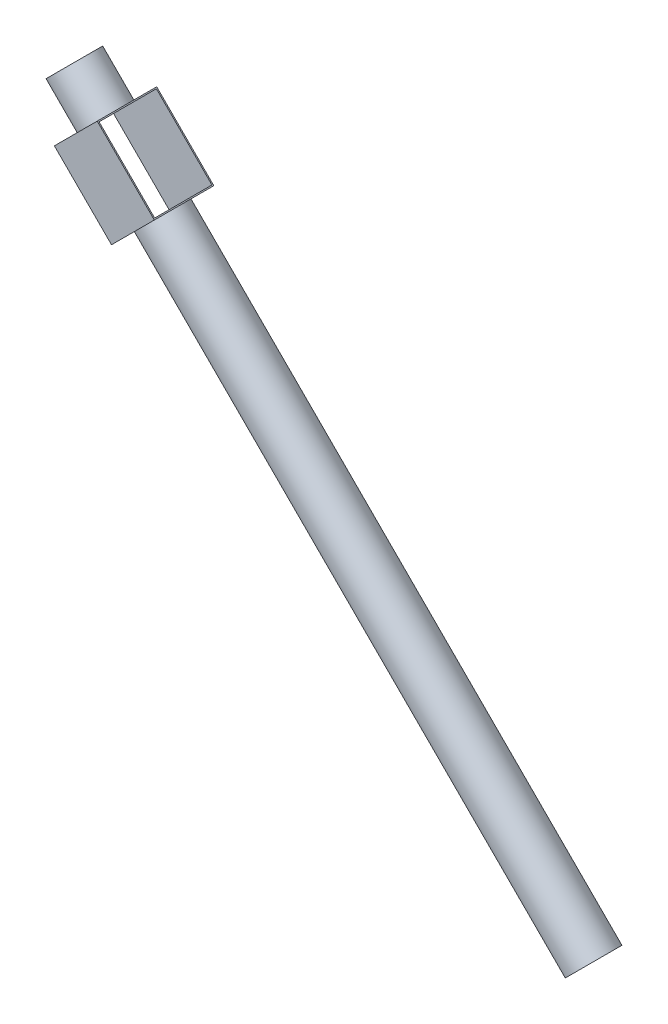
ISO-10303-21;
HEADER;
FILE_DESCRIPTION(('STEP AP214'),'2;1');
FILE_NAME('part.step','',(''),(''),'','','');
FILE_SCHEMA(('AUTOMOTIVE_DESIGN { 1 0 10303 214 1 1 1 1 }'));
ENDSEC;
DATA;
#1=APPLICATION_CONTEXT('core data for automotive mechanical design processes');
#2=APPLICATION_PROTOCOL_DEFINITION('international standard','automotive_design',2000,#1);
#3=PRODUCT_CONTEXT('',#1,'mechanical');
#4=PRODUCT('Part','Part','',(#3));
#5=PRODUCT_RELATED_PRODUCT_CATEGORY('part','',(#4));
#6=PRODUCT_DEFINITION_FORMATION('','',#4);
#7=PRODUCT_DEFINITION_CONTEXT('part definition',#1,'design');
#8=PRODUCT_DEFINITION('design','',#6,#7);
#9=PRODUCT_DEFINITION_SHAPE('','',#8);
#10=(LENGTH_UNIT() NAMED_UNIT(*) SI_UNIT(.MILLI.,.METRE.));
#11=(NAMED_UNIT(*) PLANE_ANGLE_UNIT() SI_UNIT($,.RADIAN.));
#12=(NAMED_UNIT(*) SI_UNIT($,.STERADIAN.) SOLID_ANGLE_UNIT());
#13=UNCERTAINTY_MEASURE_WITH_UNIT(LENGTH_MEASURE(1.E-05),#10,'distance_accuracy_value','');
#14=(GEOMETRIC_REPRESENTATION_CONTEXT(3) GLOBAL_UNCERTAINTY_ASSIGNED_CONTEXT((#13)) GLOBAL_UNIT_ASSIGNED_CONTEXT((#10,
#11,#12)) REPRESENTATION_CONTEXT('',''));
#15=CARTESIAN_POINT('',(0.,0.,0.));
#16=DIRECTION('',(0.,0.,1.));
#17=DIRECTION('',(1.,0.,0.));
#18=AXIS2_PLACEMENT_3D('',#15,#16,#17);
#19=CARTESIAN_POINT('',(-1325.54665954363,1414.2135623731,-27.5663130260426));
#20=DIRECTION('',(0.707106781186544,-0.707106781186551,0.));
#21=DIRECTION('',(0.707106781186551,0.707106781186544,0.));
#22=AXIS2_PLACEMENT_3D('',#19,#20,#21);
#23=CYLINDRICAL_SURFACE('',#22,63.);
#24=CARTESIAN_POINT('',(88.6669028294591,0.,-27.5663130260426));
#25=DIRECTION('',(0.707106781186544,-0.707106781186551,0.));
#26=DIRECTION('',(0.707106781186551,0.707106781186544,0.));
#27=AXIS2_PLACEMENT_3D('',#24,#25,#26);
#28=CIRCLE('',#27,63.);
#29=CARTESIAN_POINT('',(133.214630044212,44.5477272147522,-27.5663130260426));
#30=VERTEX_POINT('',#29);
#31=EDGE_CURVE('E216',#30,#30,#28,.T.);
#32=ORIENTED_EDGE('',*,*,#31,.F.);
#33=EDGE_LOOP('',(#32));
#34=FACE_BOUND('',#33,.T.);
#35=CARTESIAN_POINT('',(-1085.1303539402,1173.79725676967,-27.5663130260426));
#36=DIRECTION('',(-0.707106781186546,0.707106781186549,0.));
#37=DIRECTION('',(-0.707106781186549,-0.707106781186546,0.));
#38=AXIS2_PLACEMENT_3D('',#35,#36,#37);
#39=CIRCLE('',#38,63.);
#40=CARTESIAN_POINT('',(-1129.67808115496,1129.24952955492,-27.5663130260426));
#41=VERTEX_POINT('',#40);
#42=EDGE_CURVE('E207',#41,#41,#39,.F.);
#43=ORIENTED_EDGE('',*,*,#42,.T.);
#44=EDGE_LOOP('',(#43));
#45=FACE_BOUND('',#44,.T.);
#46=ADVANCED_FACE('F49',(#34,#45),#23,.T.);
#47=CARTESIAN_POINT('',(-1325.54665954363,1414.2135623731,-27.5663130260426));
#48=DIRECTION('',(0.707106781186544,-0.707106781186551,0.));
#49=DIRECTION('',(0.707106781186551,0.707106781186544,0.));
#50=AXIS2_PLACEMENT_3D('',#47,#48,#49);
#51=CYLINDRICAL_SURFACE('',#50,60.);
#52=CARTESIAN_POINT('',(88.6669028294591,0.,-27.5663130260426));
#53=DIRECTION('',(0.707106781186544,-0.707106781186551,0.));
#54=DIRECTION('',(0.707106781186551,0.707106781186544,0.));
#55=AXIS2_PLACEMENT_3D('',#52,#53,#54);
#56=CIRCLE('',#55,60.);
#57=CARTESIAN_POINT('',(131.093309700652,42.4264068711926,-27.5663130260426));
#58=VERTEX_POINT('',#57);
#59=EDGE_CURVE('E211',#58,#58,#56,.T.);
#60=ORIENTED_EDGE('',*,*,#59,.T.);
#61=EDGE_LOOP('',(#60));
#62=FACE_BOUND('',#61,.T.);
#63=CARTESIAN_POINT('',(-1085.1303539402,1173.79725676967,-27.5663130260426));
#64=DIRECTION('',(-0.707106781186546,0.707106781186549,0.));
#65=DIRECTION('',(-0.707106781186549,-0.707106781186546,0.));
#66=AXIS2_PLACEMENT_3D('',#63,#64,#65);
#67=CIRCLE('',#66,60.);
#68=CARTESIAN_POINT('',(-1127.5567608114,1131.37084989848,-27.5663130260426));
#69=VERTEX_POINT('',#68);
#70=EDGE_CURVE('E53',#69,#69,#67,.F.);
#71=ORIENTED_EDGE('',*,*,#70,.F.);
#72=EDGE_LOOP('',(#71));
#73=FACE_BOUND('',#72,.T.);
#74=ADVANCED_FACE('F245',(#62,#73),#51,.F.);
#75=CARTESIAN_POINT('',(88.6669028294591,0.,-27.5663130260426));
#76=DIRECTION('',(0.707106781186544,-0.707106781186551,0.));
#77=DIRECTION('',(0.707106781186551,0.707106781186544,0.));
#78=AXIS2_PLACEMENT_3D('',#75,#76,#77);
#79=PLANE('',#78);
#80=ORIENTED_EDGE('',*,*,#59,.F.);
#81=EDGE_LOOP('',(#80));
#82=FACE_BOUND('',#81,.T.);
#83=ORIENTED_EDGE('',*,*,#31,.T.);
#84=EDGE_LOOP('',(#83));
#85=FACE_BOUND('',#84,.T.);
#86=ADVANCED_FACE('F257',(#82,#85),#79,.T.);
#87=CARTESIAN_POINT('',(-1026.79404449232,1232.13356621756,53.4336869739574));
#88=DIRECTION('',(-0.707106781186546,0.707106781186549,0.));
#89=DIRECTION('',(-0.707106781186549,-0.707106781186546,0.));
#90=AXIS2_PLACEMENT_3D('',#87,#88,#89);
#91=PLANE('',#90);
#92=ORIENTED_EDGE('',*,*,#70,.T.);
#93=EDGE_LOOP('',(#92));
#94=FACE_BOUND('',#93,.T.);
#95=ADVANCED_FACE('F295',(#94),#91,.F.);
#96=ORIENTED_EDGE('',*,*,#42,.F.);
#97=EDGE_LOOP('',(#96));
#98=FACE_BOUND('',#97,.T.);
#99=DIRECTION('',(0.,0.,-1.));
#100=VECTOR('',#99,1.);
#101=CARTESIAN_POINT('',(-1143.4666633881,1115.46094732178,53.4336869739574));
#102=LINE('',#101,#100);
#103=CARTESIAN_POINT('',(-1143.4666633881,1115.46094732178,53.4336869739574));
#104=VERTEX_POINT('',#103);
#105=CARTESIAN_POINT('',(-1143.4666633881,1115.46094732178,-108.566313026043));
#106=VERTEX_POINT('',#105);
#107=EDGE_CURVE('E159',#104,#106,#102,.T.);
#108=ORIENTED_EDGE('',*,*,#107,.T.);
#109=DIRECTION('',(-0.707106781186549,-0.707106781186546,0.));
#110=VECTOR('',#109,1.);
#111=CARTESIAN_POINT('',(-1026.79404449232,1232.13356621756,-108.566313026043));
#112=LINE('',#111,#110);
#113=CARTESIAN_POINT('',(-1026.79404449232,1232.13356621756,-108.566313026043));
#114=VERTEX_POINT('',#113);
#115=EDGE_CURVE('E203',#114,#106,#112,.T.);
#116=ORIENTED_EDGE('',*,*,#115,.F.);
#117=DIRECTION('',(0.,0.,-1.));
#118=VECTOR('',#117,1.);
#119=CARTESIAN_POINT('',(-1026.79404449232,1232.13356621756,53.4336869739574));
#120=LINE('',#119,#118);
#121=CARTESIAN_POINT('',(-1026.79404449232,1232.13356621756,53.4336869739574));
#122=VERTEX_POINT('',#121);
#123=EDGE_CURVE('E165',#122,#114,#120,.T.);
#124=ORIENTED_EDGE('',*,*,#123,.F.);
#125=DIRECTION('',(-0.707106781186549,-0.707106781186546,0.));
#126=VECTOR('',#125,1.);
#127=CARTESIAN_POINT('',(-1026.79404449232,1232.13356621756,53.4336869739574));
#128=LINE('',#127,#126);
#129=EDGE_CURVE('E180',#122,#104,#128,.T.);
#130=ORIENTED_EDGE('',*,*,#129,.T.);
#131=EDGE_LOOP('',(#108,#116,#124,#130));
#132=FACE_BOUND('',#131,.T.);
#133=ADVANCED_FACE('F285',(#98,#132),#91,.F.);
#134=CARTESIAN_POINT('',(-1182.35753635336,1387.6970580786,-108.566313026043));
#135=DIRECTION('',(0.,0.,-1.));
#136=DIRECTION('',(0.,1.,0.));
#137=AXIS2_PLACEMENT_3D('',#134,#135,#136);
#138=PLANE('',#137);
#139=DIRECTION('',(0.707106781186547,-0.707106781186549,0.));
#140=VECTOR('',#139,1.);
#141=CARTESIAN_POINT('',(-1299.03015524914,1271.02443918282,-108.566313026043));
#142=LINE('',#141,#140);
#143=CARTESIAN_POINT('',(-1299.03015524914,1271.02443918282,-108.566313026043));
#144=VERTEX_POINT('',#143);
#145=EDGE_CURVE('E184',#144,#106,#142,.T.);
#146=ORIENTED_EDGE('',*,*,#145,.F.);
#147=DIRECTION('',(-0.707106781186549,-0.707106781186546,0.));
#148=VECTOR('',#147,1.);
#149=CARTESIAN_POINT('',(-1182.35753635336,1387.6970580786,-108.566313026043));
#150=LINE('',#149,#148);
#151=CARTESIAN_POINT('',(-1182.35753635336,1387.6970580786,-108.566313026043));
#152=VERTEX_POINT('',#151);
#153=EDGE_CURVE('E200',#152,#144,#150,.T.);
#154=ORIENTED_EDGE('',*,*,#153,.F.);
#155=DIRECTION('',(0.707106781186547,-0.707106781186549,0.));
#156=VECTOR('',#155,1.);
#157=CARTESIAN_POINT('',(-1182.35753635336,1387.6970580786,-108.566313026043));
#158=LINE('',#157,#156);
#159=EDGE_CURVE('E168',#152,#114,#158,.T.);
#160=ORIENTED_EDGE('',*,*,#159,.T.);
#161=ORIENTED_EDGE('',*,*,#115,.T.);
#162=EDGE_LOOP('',(#146,#154,#160,#161));
#163=FACE_BOUND('',#162,.T.);
#164=ADVANCED_FACE('F250',(#163),#138,.T.);
#165=CARTESIAN_POINT('',(-1182.35753635336,1387.6970580786,53.4336869739574));
#166=DIRECTION('',(-0.707106781186546,0.707106781186549,0.));
#167=DIRECTION('',(-0.707106781186549,-0.707106781186546,0.));
#168=AXIS2_PLACEMENT_3D('',#165,#166,#167);
#169=PLANE('',#168);
#170=CARTESIAN_POINT('',(-1240.69384580124,1329.36074863072,-27.5663130260426));
#171=DIRECTION('',(-0.707106781186546,0.707106781186549,0.));
#172=DIRECTION('',(-0.707106781186549,-0.707106781186546,0.));
#173=AXIS2_PLACEMENT_3D('',#170,#171,#172);
#174=CIRCLE('',#173,63.);
#175=CARTESIAN_POINT('',(-1285.241573016,1284.81302141596,-27.5663130260426));
#176=VERTEX_POINT('',#175);
#177=EDGE_CURVE('E11',#176,#176,#174,.F.);
#178=ORIENTED_EDGE('',*,*,#177,.T.);
#179=EDGE_LOOP('',(#178));
#180=FACE_BOUND('',#179,.T.);
#181=DIRECTION('',(0.,0.,-1.));
#182=VECTOR('',#181,1.);
#183=CARTESIAN_POINT('',(-1299.03015524914,1271.02443918282,53.4336869739574));
#184=LINE('',#183,#182);
#185=CARTESIAN_POINT('',(-1299.03015524914,1271.02443918282,53.4336869739574));
#186=VERTEX_POINT('',#185);
#187=EDGE_CURVE('E188',#186,#144,#184,.T.);
#188=ORIENTED_EDGE('',*,*,#187,.F.);
#189=DIRECTION('',(-0.707106781186549,-0.707106781186546,0.));
#190=VECTOR('',#189,1.);
#191=CARTESIAN_POINT('',(-1182.35753635336,1387.6970580786,53.4336869739574));
#192=LINE('',#191,#190);
#193=CARTESIAN_POINT('',(-1182.35753635336,1387.6970580786,53.4336869739574));
#194=VERTEX_POINT('',#193);
#195=EDGE_CURVE('E197',#194,#186,#192,.T.);
#196=ORIENTED_EDGE('',*,*,#195,.F.);
#197=DIRECTION('',(0.,0.,-1.));
#198=VECTOR('',#197,1.);
#199=CARTESIAN_POINT('',(-1182.35753635336,1387.6970580786,53.4336869739574));
#200=LINE('',#199,#198);
#201=EDGE_CURVE('E173',#194,#152,#200,.T.);
#202=ORIENTED_EDGE('',*,*,#201,.T.);
#203=ORIENTED_EDGE('',*,*,#153,.T.);
#204=EDGE_LOOP('',(#188,#196,#202,#203));
#205=FACE_BOUND('',#204,.T.);
#206=ADVANCED_FACE('F236',(#180,#205),#169,.T.);
#207=CARTESIAN_POINT('',(-1182.35753635336,1387.6970580786,53.4336869739574));
#208=DIRECTION('',(0.,0.,-1.));
#209=DIRECTION('',(0.,1.,0.));
#210=AXIS2_PLACEMENT_3D('',#207,#208,#209);
#211=PLANE('',#210);
#212=DIRECTION('',(0.707106781186547,-0.707106781186549,0.));
#213=VECTOR('',#212,1.);
#214=CARTESIAN_POINT('',(-1299.03015524914,1271.02443918282,53.4336869739574));
#215=LINE('',#214,#213);
#216=EDGE_CURVE('E169',#186,#104,#215,.T.);
#217=ORIENTED_EDGE('',*,*,#216,.T.);
#218=ORIENTED_EDGE('',*,*,#129,.F.);
#219=DIRECTION('',(0.707106781186547,-0.707106781186549,0.));
#220=VECTOR('',#219,1.);
#221=CARTESIAN_POINT('',(-1182.35753635336,1387.6970580786,53.4336869739574));
#222=LINE('',#221,#220);
#223=EDGE_CURVE('E177',#194,#122,#222,.T.);
#224=ORIENTED_EDGE('',*,*,#223,.F.);
#225=ORIENTED_EDGE('',*,*,#195,.T.);
#226=EDGE_LOOP('',(#217,#218,#224,#225));
#227=FACE_BOUND('',#226,.T.);
#228=ADVANCED_FACE('F249',(#227),#211,.F.);
#229=CARTESIAN_POINT('',(102.66976086262,102.66976086262,0.));
#230=DIRECTION('',(-0.707106781186549,-0.707106781186547,0.));
#231=DIRECTION('',(0.707106781186547,-0.707106781186549,0.));
#232=AXIS2_PLACEMENT_3D('',#229,#230,#231);
#233=PLANE('',#232);
#234=DIRECTION('',(0.,0.,-1.));
#235=VECTOR('',#234,1.);
#236=CARTESIAN_POINT('',(-1028.91536483588,1234.25488656112,50.4336869739574));
#237=LINE('',#236,#235);
#238=CARTESIAN_POINT('',(-1028.91536483588,1234.25488656112,50.4336869739574));
#239=VERTEX_POINT('',#238);
#240=CARTESIAN_POINT('',(-1028.91536483588,1234.25488656112,-105.566313026043));
#241=VERTEX_POINT('',#240);
#242=EDGE_CURVE('E150',#239,#241,#237,.T.);
#243=ORIENTED_EDGE('',*,*,#242,.F.);
#244=DIRECTION('',(0.707106781186547,-0.707106781186548,0.));
#245=VECTOR('',#244,1.);
#246=CARTESIAN_POINT('',(-1180.2362160098,1385.57573773504,50.4336869739574));
#247=LINE('',#246,#245);
#248=CARTESIAN_POINT('',(-1180.2362160098,1385.57573773504,50.4336869739574));
#249=VERTEX_POINT('',#248);
#250=EDGE_CURVE('E66',#249,#239,#247,.T.);
#251=ORIENTED_EDGE('',*,*,#250,.F.);
#252=DIRECTION('',(0.,0.,1.));
#253=VECTOR('',#252,1.);
#254=CARTESIAN_POINT('',(-1180.2362160098,1385.57573773504,-105.566313026043));
#255=LINE('',#254,#253);
#256=CARTESIAN_POINT('',(-1180.2362160098,1385.57573773504,-105.566313026043));
#257=VERTEX_POINT('',#256);
#258=EDGE_CURVE('E137',#257,#249,#255,.T.);
#259=ORIENTED_EDGE('',*,*,#258,.F.);
#260=DIRECTION('',(-0.707106781186547,0.707106781186548,0.));
#261=VECTOR('',#260,1.);
#262=CARTESIAN_POINT('',(-1028.91536483588,1234.25488656112,-105.566313026043));
#263=LINE('',#262,#261);
#264=EDGE_CURVE('E141',#241,#257,#263,.T.);
#265=ORIENTED_EDGE('',*,*,#264,.F.);
#266=EDGE_LOOP('',(#243,#251,#259,#265));
#267=FACE_BOUND('',#266,.T.);
#268=ORIENTED_EDGE('',*,*,#123,.T.);
#269=ORIENTED_EDGE('',*,*,#159,.F.);
#270=ORIENTED_EDGE('',*,*,#201,.F.);
#271=ORIENTED_EDGE('',*,*,#223,.T.);
#272=EDGE_LOOP('',(#268,#269,#270,#271));
#273=FACE_BOUND('',#272,.T.);
#274=ADVANCED_FACE('F269',(#267,#273),#233,.F.);
#275=CARTESIAN_POINT('',(-14.0028580331602,-14.0028580331601,0.));
#276=DIRECTION('',(-0.707106781186549,-0.707106781186547,0.));
#277=DIRECTION('',(0.707106781186547,-0.707106781186549,0.));
#278=AXIS2_PLACEMENT_3D('',#275,#276,#277);
#279=PLANE('',#278);
#280=DIRECTION('',(0.707106781186547,-0.707106781186548,0.));
#281=VECTOR('',#280,1.);
#282=CARTESIAN_POINT('',(-1296.90883490558,1268.90311883926,50.4336869739574));
#283=LINE('',#282,#281);
#284=CARTESIAN_POINT('',(-1296.90883490558,1268.90311883926,50.4336869739574));
#285=VERTEX_POINT('',#284);
#286=CARTESIAN_POINT('',(-1145.58798373166,1117.58226766534,50.4336869739574));
#287=VERTEX_POINT('',#286);
#288=EDGE_CURVE('E118',#285,#287,#283,.T.);
#289=ORIENTED_EDGE('',*,*,#288,.T.);
#290=DIRECTION('',(0.,0.,-1.));
#291=VECTOR('',#290,1.);
#292=CARTESIAN_POINT('',(-1145.58798373166,1117.58226766534,50.4336869739574));
#293=LINE('',#292,#291);
#294=CARTESIAN_POINT('',(-1145.58798373166,1117.58226766534,-105.566313026043));
#295=VERTEX_POINT('',#294);
#296=EDGE_CURVE('E128',#287,#295,#293,.T.);
#297=ORIENTED_EDGE('',*,*,#296,.T.);
#298=DIRECTION('',(-0.707106781186547,0.707106781186548,0.));
#299=VECTOR('',#298,1.);
#300=CARTESIAN_POINT('',(-1145.58798373166,1117.58226766534,-105.566313026043));
#301=LINE('',#300,#299);
#302=CARTESIAN_POINT('',(-1296.90883490558,1268.90311883926,-105.566313026043));
#303=VERTEX_POINT('',#302);
#304=EDGE_CURVE('E74',#295,#303,#301,.T.);
#305=ORIENTED_EDGE('',*,*,#304,.T.);
#306=DIRECTION('',(0.,0.,1.));
#307=VECTOR('',#306,1.);
#308=CARTESIAN_POINT('',(-1296.90883490558,1268.90311883926,-105.566313026043));
#309=LINE('',#308,#307);
#310=EDGE_CURVE('E125',#303,#285,#309,.T.);
#311=ORIENTED_EDGE('',*,*,#310,.T.);
#312=EDGE_LOOP('',(#289,#297,#305,#311));
#313=FACE_BOUND('',#312,.T.);
#314=ORIENTED_EDGE('',*,*,#107,.F.);
#315=ORIENTED_EDGE('',*,*,#216,.F.);
#316=ORIENTED_EDGE('',*,*,#187,.T.);
#317=ORIENTED_EDGE('',*,*,#145,.T.);
#318=EDGE_LOOP('',(#314,#315,#316,#317));
#319=FACE_BOUND('',#318,.T.);
#320=ADVANCED_FACE('F133',(#313,#319),#279,.T.);
#321=ORIENTED_EDGE('',*,*,#177,.F.);
#322=EDGE_LOOP('',(#321));
#323=FACE_BOUND('',#322,.T.);
#324=CARTESIAN_POINT('',(-1325.54665954363,1414.2135623731,-27.5663130260426));
#325=DIRECTION('',(0.707106781186544,-0.707106781186551,0.));
#326=DIRECTION('',(0.707106781186551,0.707106781186544,0.));
#327=AXIS2_PLACEMENT_3D('',#324,#325,#326);
#328=CIRCLE('',#327,63.);
#329=CARTESIAN_POINT('',(-1280.99893232888,1458.76128958785,-27.5663130260426));
#330=VERTEX_POINT('',#329);
#331=EDGE_CURVE('E220',#330,#330,#328,.T.);
#332=ORIENTED_EDGE('',*,*,#331,.T.);
#333=EDGE_LOOP('',(#332));
#334=FACE_BOUND('',#333,.T.);
#335=ADVANCED_FACE('F51',(#323,#334),#23,.T.);
#336=CARTESIAN_POINT('',(-1325.54665954363,1414.2135623731,-27.5663130260426));
#337=DIRECTION('',(0.707106781186544,-0.707106781186551,0.));
#338=DIRECTION('',(0.707106781186551,0.707106781186544,0.));
#339=AXIS2_PLACEMENT_3D('',#336,#337,#338);
#340=PLANE('',#339);
#341=CARTESIAN_POINT('',(-1325.54665954363,1414.2135623731,-27.5663130260426));
#342=DIRECTION('',(0.707106781186544,-0.707106781186551,0.));
#343=DIRECTION('',(0.707106781186551,0.707106781186544,0.));
#344=AXIS2_PLACEMENT_3D('',#341,#342,#343);
#345=CIRCLE('',#344,60.);
#346=CARTESIAN_POINT('',(-1283.12025267244,1456.6399692443,-27.5663130260426));
#347=VERTEX_POINT('',#346);
#348=EDGE_CURVE('E212',#347,#347,#345,.T.);
#349=ORIENTED_EDGE('',*,*,#348,.T.);
#350=EDGE_LOOP('',(#349));
#351=FACE_BOUND('',#350,.T.);
#352=ORIENTED_EDGE('',*,*,#331,.F.);
#353=EDGE_LOOP('',(#352));
#354=FACE_BOUND('',#353,.T.);
#355=ADVANCED_FACE('F243',(#351,#354),#340,.F.);
#356=CARTESIAN_POINT('',(-1240.69384580124,1329.36074863072,-27.5663130260426));
#357=DIRECTION('',(-0.707106781186546,0.707106781186549,0.));
#358=DIRECTION('',(-0.707106781186549,-0.707106781186546,0.));
#359=AXIS2_PLACEMENT_3D('',#356,#357,#358);
#360=CIRCLE('',#359,60.);
#361=CARTESIAN_POINT('',(-1283.12025267244,1286.93434175952,-27.5663130260426));
#362=VERTEX_POINT('',#361);
#363=EDGE_CURVE('E205',#362,#362,#360,.F.);
#364=ORIENTED_EDGE('',*,*,#363,.T.);
#365=EDGE_LOOP('',(#364));
#366=FACE_BOUND('',#365,.T.);
#367=ORIENTED_EDGE('',*,*,#348,.F.);
#368=EDGE_LOOP('',(#367));
#369=FACE_BOUND('',#368,.T.);
#370=ADVANCED_FACE('F230',(#366,#369),#51,.F.);
#371=ORIENTED_EDGE('',*,*,#363,.F.);
#372=EDGE_LOOP('',(#371));
#373=FACE_BOUND('',#372,.T.);
#374=ADVANCED_FACE('F233',(#373),#169,.T.);
#375=CARTESIAN_POINT('',(-1296.90883490558,1268.90311883926,50.4336869739574));
#376=DIRECTION('',(0.,0.,1.));
#377=DIRECTION('',(0.,-1.,0.));
#378=AXIS2_PLACEMENT_3D('',#375,#376,#377);
#379=PLANE('',#378);
#380=ORIENTED_EDGE('',*,*,#250,.T.);
#381=DIRECTION('',(0.707106781186548,0.707106781186547,0.));
#382=VECTOR('',#381,1.);
#383=CARTESIAN_POINT('',(-1145.58798373166,1117.58226766534,50.4336869739574));
#384=LINE('',#383,#382);
#385=EDGE_CURVE('E114',#287,#239,#384,.T.);
#386=ORIENTED_EDGE('',*,*,#385,.F.);
#387=ORIENTED_EDGE('',*,*,#288,.F.);
#388=DIRECTION('',(0.707106781186548,0.707106781186547,0.));
#389=VECTOR('',#388,1.);
#390=CARTESIAN_POINT('',(-1296.90883490558,1268.90311883926,50.4336869739574));
#391=LINE('',#390,#389);
#392=EDGE_CURVE('E156',#285,#249,#391,.T.);
#393=ORIENTED_EDGE('',*,*,#392,.T.);
#394=EDGE_LOOP('',(#380,#386,#387,#393));
#395=FACE_BOUND('',#394,.T.);
#396=ADVANCED_FACE('F116',(#395),#379,.F.);
#397=CARTESIAN_POINT('',(-1296.90883490558,1268.90311883926,-105.566313026043));
#398=DIRECTION('',(-0.707106781186547,0.707106781186548,0.));
#399=DIRECTION('',(-0.707106781186548,-0.707106781186547,0.));
#400=AXIS2_PLACEMENT_3D('',#397,#398,#399);
#401=PLANE('',#400);
#402=ORIENTED_EDGE('',*,*,#258,.T.);
#403=ORIENTED_EDGE('',*,*,#392,.F.);
#404=ORIENTED_EDGE('',*,*,#310,.F.);
#405=DIRECTION('',(0.707106781186548,0.707106781186547,0.));
#406=VECTOR('',#405,1.);
#407=CARTESIAN_POINT('',(-1296.90883490558,1268.90311883926,-105.566313026043));
#408=LINE('',#407,#406);
#409=EDGE_CURVE('E160',#303,#257,#408,.T.);
#410=ORIENTED_EDGE('',*,*,#409,.T.);
#411=EDGE_LOOP('',(#402,#403,#404,#410));
#412=FACE_BOUND('',#411,.T.);
#413=ADVANCED_FACE('F241',(#412),#401,.F.);
#414=CARTESIAN_POINT('',(-1145.58798373166,1117.58226766534,-105.566313026043));
#415=DIRECTION('',(0.,0.,-1.));
#416=DIRECTION('',(0.,1.,0.));
#417=AXIS2_PLACEMENT_3D('',#414,#415,#416);
#418=PLANE('',#417);
#419=ORIENTED_EDGE('',*,*,#264,.T.);
#420=ORIENTED_EDGE('',*,*,#409,.F.);
#421=ORIENTED_EDGE('',*,*,#304,.F.);
#422=DIRECTION('',(0.707106781186548,0.707106781186547,0.));
#423=VECTOR('',#422,1.);
#424=CARTESIAN_POINT('',(-1145.58798373166,1117.58226766534,-105.566313026043));
#425=LINE('',#424,#423);
#426=EDGE_CURVE('E124',#295,#241,#425,.T.);
#427=ORIENTED_EDGE('',*,*,#426,.T.);
#428=EDGE_LOOP('',(#419,#420,#421,#427));
#429=FACE_BOUND('',#428,.T.);
#430=ADVANCED_FACE('F383',(#429),#418,.F.);
#431=CARTESIAN_POINT('',(-1145.58798373166,1117.58226766534,50.4336869739574));
#432=DIRECTION('',(0.707106781186547,-0.707106781186548,0.));
#433=DIRECTION('',(0.707106781186548,0.707106781186547,0.));
#434=AXIS2_PLACEMENT_3D('',#431,#432,#433);
#435=PLANE('',#434);
#436=ORIENTED_EDGE('',*,*,#242,.T.);
#437=ORIENTED_EDGE('',*,*,#426,.F.);
#438=ORIENTED_EDGE('',*,*,#296,.F.);
#439=ORIENTED_EDGE('',*,*,#385,.T.);
#440=EDGE_LOOP('',(#436,#437,#438,#439));
#441=FACE_BOUND('',#440,.T.);
#442=ADVANCED_FACE('F129',(#441),#435,.F.);
#443=CLOSED_SHELL('',(#46,#74,#86,#95,#133,#164,#206,#228,#274,#320,#335,#355,#370,#374,#396,
#413,#430,#442));
#444=MANIFOLD_SOLID_BREP('B2',#443);
#445=ADVANCED_BREP_SHAPE_REPRESENTATION('',(#18,#444),#14);
#446=SHAPE_DEFINITION_REPRESENTATION(#9,#445);
ENDSEC;
END-ISO-10303-21;
